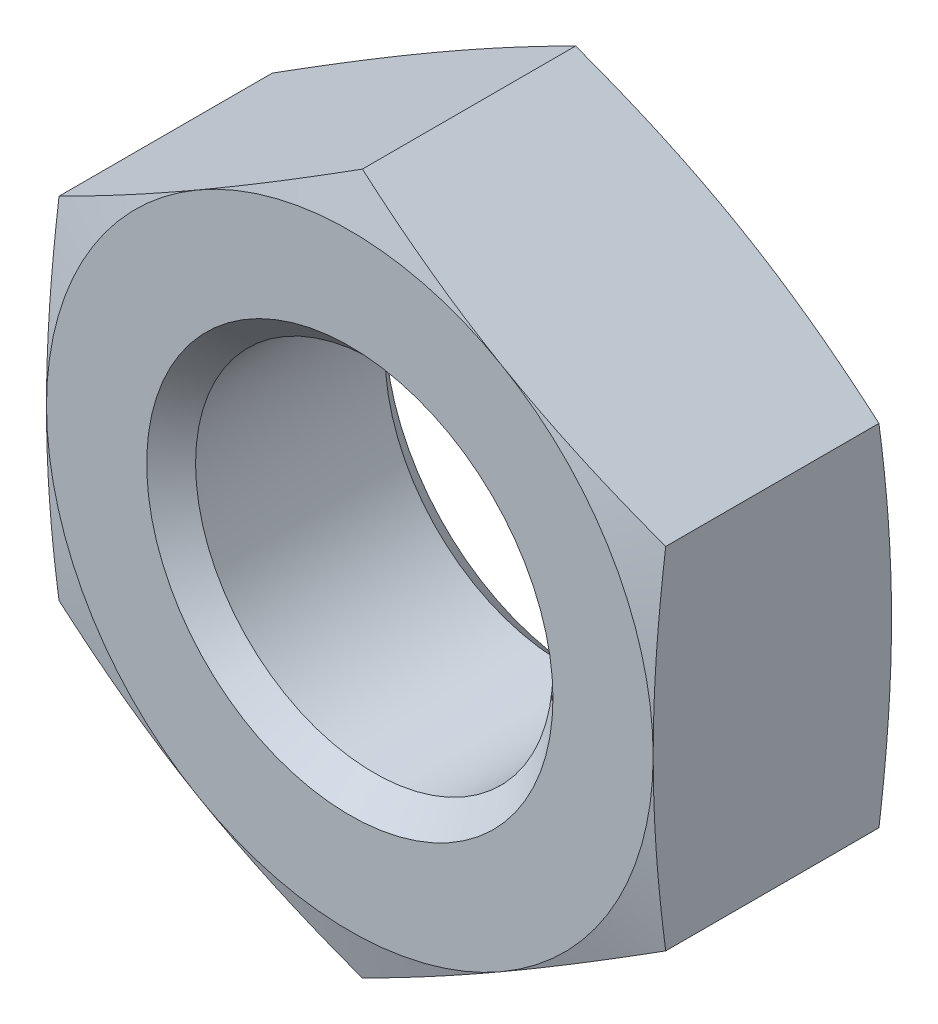
ISO-10303-21;
HEADER;
FILE_DESCRIPTION(('STEP AP214'),'2;1');
FILE_NAME('part.step','',(''),(''),'','','');
FILE_SCHEMA(('AUTOMOTIVE_DESIGN { 1 0 10303 214 1 1 1 1 }'));
ENDSEC;
DATA;
#1=APPLICATION_CONTEXT('core data for automotive mechanical design processes');
#2=APPLICATION_PROTOCOL_DEFINITION('international standard','automotive_design',2000,#1);
#3=PRODUCT_CONTEXT('',#1,'mechanical');
#4=PRODUCT('Part','Part','',(#3));
#5=PRODUCT_RELATED_PRODUCT_CATEGORY('part','',(#4));
#6=PRODUCT_DEFINITION_FORMATION('','',#4);
#7=PRODUCT_DEFINITION_CONTEXT('part definition',#1,'design');
#8=PRODUCT_DEFINITION('design','',#6,#7);
#9=PRODUCT_DEFINITION_SHAPE('','',#8);
#10=(LENGTH_UNIT() NAMED_UNIT(*) SI_UNIT(.MILLI.,.METRE.));
#11=(NAMED_UNIT(*) PLANE_ANGLE_UNIT() SI_UNIT($,.RADIAN.));
#12=(NAMED_UNIT(*) SI_UNIT($,.STERADIAN.) SOLID_ANGLE_UNIT());
#13=UNCERTAINTY_MEASURE_WITH_UNIT(LENGTH_MEASURE(1.E-05),#10,'distance_accuracy_value','');
#14=(GEOMETRIC_REPRESENTATION_CONTEXT(3) GLOBAL_UNCERTAINTY_ASSIGNED_CONTEXT((#13)) GLOBAL_UNIT_ASSIGNED_CONTEXT((#10,
#11,#12)) REPRESENTATION_CONTEXT('',''));
#15=CARTESIAN_POINT('',(0.,0.,0.));
#16=DIRECTION('',(0.,0.,1.));
#17=DIRECTION('',(1.,0.,0.));
#18=AXIS2_PLACEMENT_3D('',#15,#16,#17);
#19=CARTESIAN_POINT('',(0.,0.,0.));
#20=DIRECTION('',(0.,0.,-1.));
#21=DIRECTION('',(-1.,0.,0.));
#22=AXIS2_PLACEMENT_3D('',#19,#20,#21);
#23=PLANE('',#22);
#24=CARTESIAN_POINT('',(0.,0.,0.));
#25=DIRECTION('',(0.,0.,1.));
#26=DIRECTION('',(1.,0.,0.));
#27=AXIS2_PLACEMENT_3D('',#24,#25,#26);
#28=CIRCLE('',#27,7.112);
#29=CARTESIAN_POINT('',(7.112,0.,0.));
#30=VERTEX_POINT('',#29);
#31=CARTESIAN_POINT('',(3.55599999999998,6.15917267171491,0.));
#32=VERTEX_POINT('',#31);
#33=EDGE_CURVE('E11',#30,#32,#28,.T.);
#34=ORIENTED_EDGE('',*,*,#33,.T.);
#35=CARTESIAN_POINT('',(-3.55599999999998,6.15917267171491,0.));
#36=VERTEX_POINT('',#35);
#37=EDGE_CURVE('E43',#32,#36,#28,.T.);
#38=ORIENTED_EDGE('',*,*,#37,.T.);
#39=CARTESIAN_POINT('',(-7.112,0.,0.));
#40=VERTEX_POINT('',#39);
#41=EDGE_CURVE('E328',#36,#40,#28,.T.);
#42=ORIENTED_EDGE('',*,*,#41,.T.);
#43=CARTESIAN_POINT('',(-3.55599999999998,-6.15917267171491,0.));
#44=VERTEX_POINT('',#43);
#45=EDGE_CURVE('E321',#40,#44,#28,.T.);
#46=ORIENTED_EDGE('',*,*,#45,.T.);
#47=CARTESIAN_POINT('',(3.55599999999998,-6.15917267171491,0.));
#48=VERTEX_POINT('',#47);
#49=EDGE_CURVE('E324',#44,#48,#28,.T.);
#50=ORIENTED_EDGE('',*,*,#49,.T.);
#51=EDGE_CURVE('E44',#48,#30,#28,.T.);
#52=ORIENTED_EDGE('',*,*,#51,.T.);
#53=EDGE_LOOP('',(#34,#38,#42,#46,#50,#52));
#54=FACE_BOUND('',#53,.T.);
#55=CARTESIAN_POINT('',(0.,0.,0.));
#56=DIRECTION('',(0.,0.,1.));
#57=DIRECTION('',(1.,0.,0.));
#58=AXIS2_PLACEMENT_3D('',#55,#56,#57);
#59=CIRCLE('',#58,4.7625);
#60=CARTESIAN_POINT('',(4.7625,0.,0.));
#61=VERTEX_POINT('',#60);
#62=EDGE_CURVE('E185',#61,#61,#59,.T.);
#63=ORIENTED_EDGE('',*,*,#62,.F.);
#64=EDGE_LOOP('',(#63));
#65=FACE_BOUND('',#64,.T.);
#66=ADVANCED_FACE('F36',(#54,#65),#23,.F.);
#67=CARTESIAN_POINT('',(0.,7.112,-5.588));
#68=DIRECTION('',(0.,0.,1.));
#69=DIRECTION('',(1.,0.,0.));
#70=AXIS2_PLACEMENT_3D('',#67,#68,#69);
#71=PLANE('',#70);
#72=CARTESIAN_POINT('',(0.,0.,-5.588));
#73=DIRECTION('',(0.,0.,1.));
#74=DIRECTION('',(1.,0.,0.));
#75=AXIS2_PLACEMENT_3D('',#72,#73,#74);
#76=CIRCLE('',#75,7.112);
#77=CARTESIAN_POINT('',(7.112,0.,-5.588));
#78=VERTEX_POINT('',#77);
#79=CARTESIAN_POINT('',(3.55599999999998,6.15917267171491,-5.588));
#80=VERTEX_POINT('',#79);
#81=EDGE_CURVE('E359',#78,#80,#76,.T.);
#82=ORIENTED_EDGE('',*,*,#81,.F.);
#83=CARTESIAN_POINT('',(3.55599999999998,-6.15917267171491,-5.588));
#84=VERTEX_POINT('',#83);
#85=EDGE_CURVE('E362',#84,#78,#76,.T.);
#86=ORIENTED_EDGE('',*,*,#85,.F.);
#87=CARTESIAN_POINT('',(-3.55599999999997,-6.15917267171491,-5.588));
#88=VERTEX_POINT('',#87);
#89=EDGE_CURVE('E363',#88,#84,#76,.T.);
#90=ORIENTED_EDGE('',*,*,#89,.F.);
#91=CARTESIAN_POINT('',(-7.112,0.,-5.588));
#92=VERTEX_POINT('',#91);
#93=EDGE_CURVE('E143',#92,#88,#76,.T.);
#94=ORIENTED_EDGE('',*,*,#93,.F.);
#95=CARTESIAN_POINT('',(-3.55599999999998,6.15917267171491,-5.588));
#96=VERTEX_POINT('',#95);
#97=EDGE_CURVE('E360',#96,#92,#76,.T.);
#98=ORIENTED_EDGE('',*,*,#97,.F.);
#99=EDGE_CURVE('E356',#80,#96,#76,.T.);
#100=ORIENTED_EDGE('',*,*,#99,.F.);
#101=EDGE_LOOP('',(#82,#86,#90,#94,#98,#100));
#102=FACE_BOUND('',#101,.T.);
#103=CARTESIAN_POINT('',(0.,0.,-5.588));
#104=DIRECTION('',(0.,0.,1.));
#105=DIRECTION('',(1.,0.,0.));
#106=AXIS2_PLACEMENT_3D('',#103,#104,#105);
#107=CIRCLE('',#106,4.7625);
#108=CARTESIAN_POINT('',(4.7625,0.,-5.588));
#109=VERTEX_POINT('',#108);
#110=EDGE_CURVE('E205',#109,#109,#107,.T.);
#111=ORIENTED_EDGE('',*,*,#110,.T.);
#112=EDGE_LOOP('',(#111));
#113=FACE_BOUND('',#112,.T.);
#114=ADVANCED_FACE('F209',(#102,#113),#71,.F.);
#115=CARTESIAN_POINT('',(0.,0.,-0.38113093131403));
#116=DIRECTION('',(0.,0.,-1.));
#117=DIRECTION('',(-1.,0.,0.));
#118=AXIS2_PLACEMENT_3D('',#115,#116,#117);
#119=CONICAL_SURFACE('',#118,8.5344,1.30899693899575);
#120=CARTESIAN_POINT('',(-7.1122,4.10599964442276,-0.294836742096555));
#121=CARTESIAN_POINT('',(-6.81683993081672,4.27652585987359,-0.249125164728864));
#122=CARTESIAN_POINT('',(-6.52094434048185,4.44736125860545,-0.20762659679499));
#123=CARTESIAN_POINT('',(-5.92810818304476,4.7896353736871,-0.134717505456008));
#124=CARTESIAN_POINT('',(-5.63116724085637,4.96107430659299,-0.103311079605058));
#125=CARTESIAN_POINT('',(-5.03804073152478,5.30351605641908,-0.0524197564883193));
#126=CARTESIAN_POINT('',(-4.741859175091,5.47451655775512,-0.0328741692317776));
#127=CARTESIAN_POINT('',(-4.14911835631021,5.81673562903789,-0.00666553721840267));
#128=CARTESIAN_POINT('',(-3.85255917815511,5.9879541503764,0.));
#129=CARTESIAN_POINT('',(-3.25944082184489,6.3303911930534,0.));
#130=CARTESIAN_POINT('',(-2.96288164368979,6.50160971439191,-0.00666553721840112));
#131=CARTESIAN_POINT('',(-2.370140824909,6.84382878567467,-0.0328741692317746));
#132=CARTESIAN_POINT('',(-2.07395926847522,7.01482928701071,-0.0524197564883157));
#133=CARTESIAN_POINT('',(-1.48083275914363,7.35727103683681,-0.103311079605053));
#134=CARTESIAN_POINT('',(-1.18389181695524,7.5287099697427,-0.134717505456002));
#135=CARTESIAN_POINT('',(-0.591055659518146,7.87098408482435,-0.207626596794984));
#136=CARTESIAN_POINT('',(-0.295160069183277,8.04181948355621,-0.249125164728857));
#137=CARTESIAN_POINT('',(0.000199999999999879,8.21234569900704,-0.294836742096548));
#138=B_SPLINE_CURVE_WITH_KNOTS('',3,(#120,#121,#122,#123,#124,#125,#126,#127,#128,#129,#130,
#131,#132,#133,#134,#135,#136,#137),.UNSPECIFIED.,.F.,.F.,(4,2,2,2,2,2,2,2,4),(0.,
1.03236062173259,2.06513986860236,3.09258898445301,4.11983925526856,5.14708952608412,
6.17453864193476,7.20731788880454,8.23967851053712),.UNSPECIFIED.);
#139=CARTESIAN_POINT('',(-7.112,4.1061151144766,-0.294805801336327));
#140=VERTEX_POINT('',#139);
#141=EDGE_CURVE('E336',#140,#36,#138,.T.);
#142=ORIENTED_EDGE('',*,*,#141,.F.);
#143=CARTESIAN_POINT('',(-7.112,-10.8621903802248,-1.57322706787647));
#144=CARTESIAN_POINT('',(-7.112,-10.5395393800562,-1.50091696809899));
#145=CARTESIAN_POINT('',(-7.112,-10.2166865718283,-1.42949122415335));
#146=CARTESIAN_POINT('',(-7.112,-9.57047822851532,-1.28888580152898));
#147=CARTESIAN_POINT('',(-7.112,-9.24712267234835,-1.21970621985545));
#148=CARTESIAN_POINT('',(-7.112,-8.5995200627725,-1.08401027295991));
#149=CARTESIAN_POINT('',(-7.112,-8.27527244600282,-1.01749658678487));
#150=CARTESIAN_POINT('',(-7.112,-7.62610232214974,-0.887850374036113));
#151=CARTESIAN_POINT('',(-7.112,-7.30117982078632,-0.8247178189261));
#152=CARTESIAN_POINT('',(-7.112,-6.65313387237915,-0.703125566688923));
#153=CARTESIAN_POINT('',(-7.112,-6.33001668255371,-0.644632684578964));
#154=CARTESIAN_POINT('',(-7.112,-5.68290093786014,-0.532753637731037));
#155=CARTESIAN_POINT('',(-7.112,-5.35890240254682,-0.479367360625761));
#156=CARTESIAN_POINT('',(-7.112,-4.70996107077876,-0.378903566930172));
#157=CARTESIAN_POINT('',(-7.112,-4.38501839561018,-0.331825273692812));
#158=CARTESIAN_POINT('',(-7.112,-3.73409901356861,-0.245364767985313));
#159=CARTESIAN_POINT('',(-7.112,-3.40812230572716,-0.2059825627253));
#160=CARTESIAN_POINT('',(-7.112,-2.75145723580076,-0.136029395787059));
#161=CARTESIAN_POINT('',(-7.112,-2.42075747702392,-0.105563829583138));
#162=CARTESIAN_POINT('',(-7.112,-1.75852657520964,-0.0555456253999336));
#163=CARTESIAN_POINT('',(-7.112,-1.42699545141392,-0.0359927371490908));
#164=CARTESIAN_POINT('',(-7.112,-0.763582735895716,-0.00894029218373607));
#165=CARTESIAN_POINT('',(-7.112,-0.431701372123297,-0.00143525798414603));
#166=CARTESIAN_POINT('',(-7.112,0.232109083172494,0.00106005450740887));
#167=CARTESIAN_POINT('',(-7.112,0.564038174654477,-0.00394965641241315));
#168=CARTESIAN_POINT('',(-7.112,1.22868554534926,-0.0262021054193241));
#169=CARTESIAN_POINT('',(-7.112,1.56140230772255,-0.043489241985777));
#170=CARTESIAN_POINT('',(-7.112,2.22605336021326,-0.0893097661187412));
#171=CARTESIAN_POINT('',(-7.112,2.55798763284348,-0.117843402671249));
#172=CARTESIAN_POINT('',(-7.112,3.2210709139855,-0.184715603901281));
#173=CARTESIAN_POINT('',(-7.112,3.55221926714478,-0.223060567325219));
#174=CARTESIAN_POINT('',(-7.112,4.21345025232476,-0.307959864517774));
#175=CARTESIAN_POINT('',(-7.112,4.54353288099616,-0.354514224060884));
#176=CARTESIAN_POINT('',(-7.112,5.18084428686068,-0.451037958316589));
#177=CARTESIAN_POINT('',(-7.112,5.48813890421502,-0.500576999648263));
#178=CARTESIAN_POINT('',(-7.112,6.1019181959131,-0.604463692319849));
#179=CARTESIAN_POINT('',(-7.112,6.40840284792414,-0.658811474852727));
#180=CARTESIAN_POINT('',(-7.112,7.02067434834207,-0.77143588349716));
#181=CARTESIAN_POINT('',(-7.112,7.3264611316708,-0.829712861688587));
#182=CARTESIAN_POINT('',(-7.112,7.93740665686525,-0.949478379785007));
#183=CARTESIAN_POINT('',(-7.112,8.24256539054058,-1.01096696130012));
#184=CARTESIAN_POINT('',(-7.112,9.15736958006377,-1.19937760033226));
#185=CARTESIAN_POINT('',(-7.112,9.76620698844964,-1.33021895563952));
#186=CARTESIAN_POINT('',(-7.112,10.9822626667456,-1.59898474911041));
#187=CARTESIAN_POINT('',(-7.112,11.5894810291877,-1.73690877294287));
#188=CARTESIAN_POINT('',(-7.112,12.7967984662328,-2.01636676367255));
#189=CARTESIAN_POINT('',(-7.112,13.3969088656803,-2.15785193980808));
#190=CARTESIAN_POINT('',(-7.112,14.5962924563601,-2.44436443899914));
#191=CARTESIAN_POINT('',(-7.112,15.1955656321298,-2.58939182658433));
#192=CARTESIAN_POINT('',(-7.112,16.3927321601189,-2.88188317193209));
#193=CARTESIAN_POINT('',(-7.112,16.9906263024909,-3.02934390204586));
#194=CARTESIAN_POINT('',(-7.112,18.1858937839348,-3.32627890644586));
#195=CARTESIAN_POINT('',(-7.112,18.7832671395427,-3.47575311412247));
#196=CARTESIAN_POINT('',(-7.112,19.3804589835755,-3.62594037951843));
#197=B_SPLINE_CURVE_WITH_KNOTS('',3,(#143,#144,#145,#146,#147,#148,#149,#150,#151,#152,#153,
#154,#155,#156,#157,#158,#159,#160,#161,#162,#163,#164,#165,#166,#167,#168,#169,#170,#171,#172,
#173,#174,#175,#176,#177,#178,#179,#180,#181,#182,#183,#184,#185,#186,#187,#188,#189,#190,#191,
#192,#193,#194,#195,#196),.UNSPECIFIED.,.F.,.F.,(4,2,2,2,2,2,2,2,2,2,2,2,2,2,2,2,2,2,2,2,2,2,2,
2,2,2,4),(0.,0.991967628235665,1.98397803983594,2.97696156258089,3.96993670335537,
4.9550106822231,5.94006298023104,6.92499388567646,7.90992571385571,8.90606843566219,
9.90218831097408,10.8978551779253,11.893521186572,12.8928062468735,13.8921134315661,
14.8920740125303,15.8920377330598,16.825779045118,17.7595458395382,18.6933964166397,
19.6272590958812,21.495399659747,23.3634310629121,25.213106344653,27.0628153477217,
28.9102417570089,30.7576071993245),.UNSPECIFIED.);
#198=EDGE_CURVE('E154',#40,#140,#197,.T.);
#199=ORIENTED_EDGE('',*,*,#198,.F.);
#200=ORIENTED_EDGE('',*,*,#41,.F.);
#201=EDGE_LOOP('',(#142,#199,#200));
#202=FACE_BOUND('',#201,.T.);
#203=ADVANCED_FACE('F227',(#202),#119,.T.);
#204=CARTESIAN_POINT('',(0.,8.2122302289532,-0.29480580133632));
#205=VERTEX_POINT('',#204);
#206=EDGE_CURVE('E333',#36,#205,#138,.T.);
#207=ORIENTED_EDGE('',*,*,#206,.F.);
#208=ORIENTED_EDGE('',*,*,#37,.F.);
#209=CARTESIAN_POINT('',(-0.0002,8.21234569900704,-0.294836742096548));
#210=CARTESIAN_POINT('',(0.295160069183277,8.04181948355621,-0.249125164728857));
#211=CARTESIAN_POINT('',(0.591055659518147,7.87098408482435,-0.207626596794983));
#212=CARTESIAN_POINT('',(1.18389181695524,7.5287099697427,-0.134717505456002));
#213=CARTESIAN_POINT('',(1.48083275914363,7.35727103683681,-0.103311079605053));
#214=CARTESIAN_POINT('',(2.07395926847522,7.01482928701071,-0.0524197564883157));
#215=CARTESIAN_POINT('',(2.370140824909,6.84382878567467,-0.0328741692317747));
#216=CARTESIAN_POINT('',(2.96288164368979,6.50160971439191,-0.00666553721840107));
#217=CARTESIAN_POINT('',(3.2594408218449,6.3303911930534,0.));
#218=CARTESIAN_POINT('',(3.85255917815511,5.9879541503764,0.));
#219=CARTESIAN_POINT('',(4.14911835631021,5.81673562903789,-0.00666553721840278));
#220=CARTESIAN_POINT('',(4.74185917509101,5.47451655775512,-0.0328741692317779));
#221=CARTESIAN_POINT('',(5.03804073152478,5.30351605641908,-0.0524197564883196));
#222=CARTESIAN_POINT('',(5.63116724085637,4.96107430659298,-0.103311079605058));
#223=CARTESIAN_POINT('',(5.92810818304476,4.7896353736871,-0.134717505456008));
#224=CARTESIAN_POINT('',(6.52094434048186,4.44736125860545,-0.20762659679499));
#225=CARTESIAN_POINT('',(6.81683993081672,4.27652585987359,-0.249125164728864));
#226=CARTESIAN_POINT('',(7.1122,4.10599964442276,-0.294836742096555));
#227=B_SPLINE_CURVE_WITH_KNOTS('',3,(#209,#210,#211,#212,#213,#214,#215,#216,#217,#218,#219,
#220,#221,#222,#223,#224,#225,#226),.UNSPECIFIED.,.F.,.F.,(4,2,2,2,2,2,2,2,4),(0.,
1.03236062173259,2.06513986860236,3.09258898445301,4.11983925526856,5.14708952608412,
6.17453864193476,7.20731788880454,8.23967851053712),.UNSPECIFIED.);
#228=EDGE_CURVE('E266',#205,#32,#227,.T.);
#229=ORIENTED_EDGE('',*,*,#228,.F.);
#230=EDGE_LOOP('',(#207,#208,#229));
#231=FACE_BOUND('',#230,.T.);
#232=ADVANCED_FACE('F275',(#231),#119,.T.);
#233=CARTESIAN_POINT('',(7.112,4.1061151144766,-0.294805801336327));
#234=VERTEX_POINT('',#233);
#235=EDGE_CURVE('E261',#32,#234,#227,.T.);
#236=ORIENTED_EDGE('',*,*,#235,.F.);
#237=ORIENTED_EDGE('',*,*,#33,.F.);
#238=CARTESIAN_POINT('',(7.112,-10.8621903802248,-1.57322706787647));
#239=CARTESIAN_POINT('',(7.112,-10.5395393800562,-1.50091696809899));
#240=CARTESIAN_POINT('',(7.112,-10.2166865718283,-1.42949122415335));
#241=CARTESIAN_POINT('',(7.112,-9.57047822851532,-1.28888580152898));
#242=CARTESIAN_POINT('',(7.112,-9.24712267234835,-1.21970621985545));
#243=CARTESIAN_POINT('',(7.112,-8.5995200627725,-1.08401027295991));
#244=CARTESIAN_POINT('',(7.112,-8.27527244600282,-1.01749658678487));
#245=CARTESIAN_POINT('',(7.112,-7.62610232214974,-0.887850374036113));
#246=CARTESIAN_POINT('',(7.112,-7.30117982078632,-0.8247178189261));
#247=CARTESIAN_POINT('',(7.112,-6.65313387237915,-0.703125566688923));
#248=CARTESIAN_POINT('',(7.112,-6.33001668255371,-0.644632684578964));
#249=CARTESIAN_POINT('',(7.112,-5.68290093786014,-0.532753637731037));
#250=CARTESIAN_POINT('',(7.112,-5.35890240254682,-0.479367360625761));
#251=CARTESIAN_POINT('',(7.112,-4.70996107077876,-0.378903566930172));
#252=CARTESIAN_POINT('',(7.112,-4.38501839561018,-0.331825273692812));
#253=CARTESIAN_POINT('',(7.112,-3.73409901356861,-0.245364767985313));
#254=CARTESIAN_POINT('',(7.112,-3.40812230572716,-0.2059825627253));
#255=CARTESIAN_POINT('',(7.112,-2.75145723580076,-0.136029395787059));
#256=CARTESIAN_POINT('',(7.112,-2.42075747702392,-0.105563829583138));
#257=CARTESIAN_POINT('',(7.112,-1.75852657520964,-0.0555456253999336));
#258=CARTESIAN_POINT('',(7.112,-1.42699545141392,-0.0359927371490908));
#259=CARTESIAN_POINT('',(7.112,-0.763582735895716,-0.00894029218373607));
#260=CARTESIAN_POINT('',(7.112,-0.431701372123297,-0.00143525798414603));
#261=CARTESIAN_POINT('',(7.112,0.232109083172494,0.00106005450740887));
#262=CARTESIAN_POINT('',(7.112,0.564038174654477,-0.00394965641241315));
#263=CARTESIAN_POINT('',(7.112,1.22868554534926,-0.0262021054193241));
#264=CARTESIAN_POINT('',(7.112,1.56140230772255,-0.043489241985777));
#265=CARTESIAN_POINT('',(7.112,2.22605336021326,-0.0893097661187412));
#266=CARTESIAN_POINT('',(7.112,2.55798763284348,-0.117843402671249));
#267=CARTESIAN_POINT('',(7.112,3.2210709139855,-0.184715603901281));
#268=CARTESIAN_POINT('',(7.112,3.55221926714478,-0.223060567325219));
#269=CARTESIAN_POINT('',(7.112,4.21345025232476,-0.307959864517774));
#270=CARTESIAN_POINT('',(7.112,4.54353288099616,-0.354514224060884));
#271=CARTESIAN_POINT('',(7.112,5.18084428686068,-0.451037958316589));
#272=CARTESIAN_POINT('',(7.112,5.48813890421502,-0.500576999648263));
#273=CARTESIAN_POINT('',(7.112,6.1019181959131,-0.604463692319849));
#274=CARTESIAN_POINT('',(7.112,6.40840284792414,-0.658811474852727));
#275=CARTESIAN_POINT('',(7.112,7.02067434834207,-0.77143588349716));
#276=CARTESIAN_POINT('',(7.112,7.3264611316708,-0.829712861688587));
#277=CARTESIAN_POINT('',(7.112,7.93740665686525,-0.949478379785007));
#278=CARTESIAN_POINT('',(7.112,8.24256539054058,-1.01096696130012));
#279=CARTESIAN_POINT('',(7.112,9.15736958006377,-1.19937760033226));
#280=CARTESIAN_POINT('',(7.112,9.76620698844964,-1.33021895563952));
#281=CARTESIAN_POINT('',(7.112,10.9822626667456,-1.59898474911041));
#282=CARTESIAN_POINT('',(7.112,11.5894810291877,-1.73690877294287));
#283=CARTESIAN_POINT('',(7.112,12.7967984662328,-2.01636676367255));
#284=CARTESIAN_POINT('',(7.112,13.3969088656803,-2.15785193980808));
#285=CARTESIAN_POINT('',(7.112,14.5962924563601,-2.44436443899914));
#286=CARTESIAN_POINT('',(7.112,15.1955656321298,-2.58939182658433));
#287=CARTESIAN_POINT('',(7.112,16.3927321601189,-2.88188317193209));
#288=CARTESIAN_POINT('',(7.112,16.9906263024909,-3.02934390204586));
#289=CARTESIAN_POINT('',(7.112,18.1858937839348,-3.32627890644586));
#290=CARTESIAN_POINT('',(7.112,18.7832671395427,-3.47575311412247));
#291=CARTESIAN_POINT('',(7.112,19.3804589835755,-3.62594037951843));
#292=B_SPLINE_CURVE_WITH_KNOTS('',3,(#238,#239,#240,#241,#242,#243,#244,#245,#246,#247,#248,
#249,#250,#251,#252,#253,#254,#255,#256,#257,#258,#259,#260,#261,#262,#263,#264,#265,#266,#267,
#268,#269,#270,#271,#272,#273,#274,#275,#276,#277,#278,#279,#280,#281,#282,#283,#284,#285,#286,
#287,#288,#289,#290,#291),.UNSPECIFIED.,.F.,.F.,(4,2,2,2,2,2,2,2,2,2,2,2,2,2,2,2,2,2,2,2,2,2,2,
2,2,2,4),(0.,0.991967628235665,1.98397803983594,2.97696156258089,3.96993670335537,
4.9550106822231,5.94006298023104,6.92499388567646,7.90992571385571,8.90606843566219,
9.90218831097408,10.8978551779253,11.893521186572,12.8928062468735,13.8921134315661,
14.8920740125303,15.8920377330598,16.825779045118,17.7595458395382,18.6933964166397,
19.6272590958812,21.495399659747,23.3634310629121,25.213106344653,27.0628153477217,
28.9102417570089,30.7576071993245),.UNSPECIFIED.);
#293=EDGE_CURVE('E293',#234,#30,#292,.F.);
#294=ORIENTED_EDGE('',*,*,#293,.F.);
#295=EDGE_LOOP('',(#236,#237,#294));
#296=FACE_BOUND('',#295,.T.);
#297=ADVANCED_FACE('F347',(#296),#119,.T.);
#298=CARTESIAN_POINT('',(7.112,-4.1061151144766,-0.294805801336327));
#299=VERTEX_POINT('',#298);
#300=EDGE_CURVE('E289',#30,#299,#292,.F.);
#301=ORIENTED_EDGE('',*,*,#300,.F.);
#302=ORIENTED_EDGE('',*,*,#51,.F.);
#303=CARTESIAN_POINT('',(7.1122,-4.10599964442276,-0.294836742096555));
#304=CARTESIAN_POINT('',(6.81683993081672,-4.27652585987359,-0.249125164728864));
#305=CARTESIAN_POINT('',(6.52094434048185,-4.44736125860545,-0.20762659679499));
#306=CARTESIAN_POINT('',(5.92810818304476,-4.7896353736871,-0.134717505456008));
#307=CARTESIAN_POINT('',(5.63116724085637,-4.96107430659299,-0.103311079605058));
#308=CARTESIAN_POINT('',(5.03804073152478,-5.30351605641908,-0.0524197564883193));
#309=CARTESIAN_POINT('',(4.741859175091,-5.47451655775512,-0.0328741692317776));
#310=CARTESIAN_POINT('',(4.14911835631021,-5.81673562903789,-0.00666553721840267));
#311=CARTESIAN_POINT('',(3.85255917815511,-5.9879541503764,0.));
#312=CARTESIAN_POINT('',(3.25944082184489,-6.3303911930534,0.));
#313=CARTESIAN_POINT('',(2.96288164368979,-6.50160971439191,-0.00666553721840112));
#314=CARTESIAN_POINT('',(2.370140824909,-6.84382878567467,-0.0328741692317746));
#315=CARTESIAN_POINT('',(2.07395926847522,-7.01482928701071,-0.0524197564883157));
#316=CARTESIAN_POINT('',(1.48083275914363,-7.35727103683681,-0.103311079605053));
#317=CARTESIAN_POINT('',(1.18389181695524,-7.5287099697427,-0.134717505456002));
#318=CARTESIAN_POINT('',(0.591055659518146,-7.87098408482435,-0.207626596794984));
#319=CARTESIAN_POINT('',(0.295160069183277,-8.04181948355621,-0.249125164728857));
#320=CARTESIAN_POINT('',(-0.000199999999999879,-8.21234569900704,-0.294836742096548));
#321=B_SPLINE_CURVE_WITH_KNOTS('',3,(#303,#304,#305,#306,#307,#308,#309,#310,#311,#312,#313,
#314,#315,#316,#317,#318,#319,#320),.UNSPECIFIED.,.F.,.F.,(4,2,2,2,2,2,2,2,4),(0.,
1.03236062173259,2.06513986860236,3.09258898445301,4.11983925526856,5.14708952608412,
6.17453864193476,7.20731788880454,8.23967851053712),.UNSPECIFIED.);
#322=EDGE_CURVE('E299',#299,#48,#321,.T.);
#323=ORIENTED_EDGE('',*,*,#322,.F.);
#324=EDGE_LOOP('',(#301,#302,#323));
#325=FACE_BOUND('',#324,.T.);
#326=ADVANCED_FACE('F387',(#325),#119,.T.);
#327=CARTESIAN_POINT('',(0.,-8.2122302289532,-0.29480580133632));
#328=VERTEX_POINT('',#327);
#329=EDGE_CURVE('E284',#48,#328,#321,.T.);
#330=ORIENTED_EDGE('',*,*,#329,.F.);
#331=ORIENTED_EDGE('',*,*,#49,.F.);
#332=CARTESIAN_POINT('',(0.0002,-8.21234569900704,-0.294836742096548));
#333=CARTESIAN_POINT('',(-0.295160069183277,-8.04181948355621,-0.249125164728857));
#334=CARTESIAN_POINT('',(-0.591055659518147,-7.87098408482435,-0.207626596794983));
#335=CARTESIAN_POINT('',(-1.18389181695524,-7.5287099697427,-0.134717505456002));
#336=CARTESIAN_POINT('',(-1.48083275914363,-7.35727103683681,-0.103311079605053));
#337=CARTESIAN_POINT('',(-2.07395926847522,-7.01482928701071,-0.0524197564883157));
#338=CARTESIAN_POINT('',(-2.370140824909,-6.84382878567467,-0.0328741692317747));
#339=CARTESIAN_POINT('',(-2.96288164368979,-6.50160971439191,-0.00666553721840107));
#340=CARTESIAN_POINT('',(-3.2594408218449,-6.3303911930534,0.));
#341=CARTESIAN_POINT('',(-3.85255917815511,-5.9879541503764,0.));
#342=CARTESIAN_POINT('',(-4.14911835631021,-5.81673562903789,-0.00666553721840278));
#343=CARTESIAN_POINT('',(-4.74185917509101,-5.47451655775512,-0.0328741692317779));
#344=CARTESIAN_POINT('',(-5.03804073152478,-5.30351605641908,-0.0524197564883196));
#345=CARTESIAN_POINT('',(-5.63116724085637,-4.96107430659298,-0.103311079605058));
#346=CARTESIAN_POINT('',(-5.92810818304476,-4.7896353736871,-0.134717505456008));
#347=CARTESIAN_POINT('',(-6.52094434048186,-4.44736125860545,-0.20762659679499));
#348=CARTESIAN_POINT('',(-6.81683993081672,-4.27652585987359,-0.249125164728864));
#349=CARTESIAN_POINT('',(-7.1122,-4.10599964442276,-0.294836742096555));
#350=B_SPLINE_CURVE_WITH_KNOTS('',3,(#332,#333,#334,#335,#336,#337,#338,#339,#340,#341,#342,
#343,#344,#345,#346,#347,#348,#349),.UNSPECIFIED.,.F.,.F.,(4,2,2,2,2,2,2,2,4),(0.,
1.03236062173259,2.06513986860236,3.09258898445301,4.11983925526856,5.14708952608412,
6.17453864193476,7.20731788880454,8.23967851053712),.UNSPECIFIED.);
#351=EDGE_CURVE('E146',#328,#44,#350,.T.);
#352=ORIENTED_EDGE('',*,*,#351,.F.);
#353=EDGE_LOOP('',(#330,#331,#352));
#354=FACE_BOUND('',#353,.T.);
#355=ADVANCED_FACE('F325',(#354),#119,.T.);
#356=CARTESIAN_POINT('',(-7.112,-4.1061151144766,-0.294805801336327));
#357=VERTEX_POINT('',#356);
#358=EDGE_CURVE('E138',#44,#357,#350,.T.);
#359=ORIENTED_EDGE('',*,*,#358,.F.);
#360=ORIENTED_EDGE('',*,*,#45,.F.);
#361=EDGE_CURVE('E51',#357,#40,#197,.T.);
#362=ORIENTED_EDGE('',*,*,#361,.F.);
#363=EDGE_LOOP('',(#359,#360,#362));
#364=FACE_BOUND('',#363,.T.);
#365=ADVANCED_FACE('F277',(#364),#119,.T.);
#366=CARTESIAN_POINT('',(0.,8.2122302289532,-5.588));
#367=DIRECTION('',(-0.499999999999998,0.86602540378444,0.));
#368=DIRECTION('',(-0.86602540378444,-0.499999999999998,0.));
#369=AXIS2_PLACEMENT_3D('',#366,#367,#368);
#370=PLANE('',#369);
#371=ORIENTED_EDGE('',*,*,#141,.T.);
#372=ORIENTED_EDGE('',*,*,#206,.T.);
#373=DIRECTION('',(0.,0.,1.));
#374=VECTOR('',#373,1.);
#375=CARTESIAN_POINT('',(0.,8.2122302289532,-5.588));
#376=LINE('',#375,#374);
#377=CARTESIAN_POINT('',(0.,8.2122302289532,-5.2931941986637));
#378=VERTEX_POINT('',#377);
#379=EDGE_CURVE('E131',#378,#205,#376,.T.);
#380=ORIENTED_EDGE('',*,*,#379,.F.);
#381=CARTESIAN_POINT('',(0.000200000000000083,8.21234569900704,-5.29316325790348));
#382=CARTESIAN_POINT('',(-0.295160069183278,8.04181948355621,-5.33887483527116));
#383=CARTESIAN_POINT('',(-0.591055659518146,7.87098408482435,-5.38037340320503));
#384=CARTESIAN_POINT('',(-1.18389181695524,7.5287099697427,-5.45328249454401));
#385=CARTESIAN_POINT('',(-1.48083275914363,7.35727103683681,-5.48468892039496));
#386=CARTESIAN_POINT('',(-2.07395926847522,7.01482928701071,-5.53558024351169));
#387=CARTESIAN_POINT('',(-2.370140824909,6.84382878567467,-5.55512583076823));
#388=CARTESIAN_POINT('',(-2.96288164368979,6.50160971439191,-5.5813344627816));
#389=CARTESIAN_POINT('',(-3.25944082184489,6.3303911930534,-5.58800000000001));
#390=CARTESIAN_POINT('',(-3.85255917815511,5.9879541503764,-5.58800000000001));
#391=CARTESIAN_POINT('',(-4.14911835631021,5.81673562903789,-5.5813344627816));
#392=CARTESIAN_POINT('',(-4.741859175091,5.47451655775512,-5.55512583076823));
#393=CARTESIAN_POINT('',(-5.03804073152478,5.30351605641908,-5.53558024351168));
#394=CARTESIAN_POINT('',(-5.63116724085637,4.96107430659299,-5.48468892039495));
#395=CARTESIAN_POINT('',(-5.92810818304476,4.7896353736871,-5.453282494544));
#396=CARTESIAN_POINT('',(-6.52094434048185,4.44736125860545,-5.38037340320503));
#397=CARTESIAN_POINT('',(-6.81683993081672,4.27652585987359,-5.33887483527116));
#398=CARTESIAN_POINT('',(-7.1122,4.10599964442276,-5.29316325790347));
#399=B_SPLINE_CURVE_WITH_KNOTS('',3,(#381,#382,#383,#384,#385,#386,#387,#388,#389,#390,#391,
#392,#393,#394,#395,#396,#397,#398),.UNSPECIFIED.,.F.,.F.,(4,2,2,2,2,2,2,2,4),(0.,
1.03236062173258,2.06513986860236,3.092588984453,4.11983925526856,5.14708952608411,
6.17453864193476,7.20731788880453,8.23967851053712),.UNSPECIFIED.);
#400=EDGE_CURVE('E337',#378,#96,#399,.T.);
#401=ORIENTED_EDGE('',*,*,#400,.T.);
#402=CARTESIAN_POINT('',(-7.112,4.1061151144766,-5.2931941986637));
#403=VERTEX_POINT('',#402);
#404=EDGE_CURVE('E268',#96,#403,#399,.T.);
#405=ORIENTED_EDGE('',*,*,#404,.T.);
#406=DIRECTION('',(0.,0.,1.));
#407=VECTOR('',#406,1.);
#408=CARTESIAN_POINT('',(-7.112,4.1061151144766,-5.588));
#409=LINE('',#408,#407);
#410=EDGE_CURVE('E140',#403,#140,#409,.T.);
#411=ORIENTED_EDGE('',*,*,#410,.T.);
#412=EDGE_LOOP('',(#371,#372,#380,#401,#405,#411));
#413=FACE_BOUND('',#412,.T.);
#414=ADVANCED_FACE('F177',(#413),#370,.T.);
#415=CARTESIAN_POINT('',(7.112,4.1061151144766,-5.588));
#416=DIRECTION('',(0.499999999999998,0.86602540378444,0.));
#417=DIRECTION('',(-0.86602540378444,0.499999999999998,0.));
#418=AXIS2_PLACEMENT_3D('',#415,#416,#417);
#419=PLANE('',#418);
#420=ORIENTED_EDGE('',*,*,#228,.T.);
#421=ORIENTED_EDGE('',*,*,#235,.T.);
#422=DIRECTION('',(0.,0.,1.));
#423=VECTOR('',#422,1.);
#424=CARTESIAN_POINT('',(7.112,4.1061151144766,-5.588));
#425=LINE('',#424,#423);
#426=CARTESIAN_POINT('',(7.112,4.1061151144766,-5.2931941986637));
#427=VERTEX_POINT('',#426);
#428=EDGE_CURVE('E192',#427,#234,#425,.T.);
#429=ORIENTED_EDGE('',*,*,#428,.F.);
#430=CARTESIAN_POINT('',(7.1122,4.10599964442276,-5.29316325790347));
#431=CARTESIAN_POINT('',(6.81683993081672,4.27652585987359,-5.33887483527116));
#432=CARTESIAN_POINT('',(6.52094434048185,4.44736125860545,-5.38037340320503));
#433=CARTESIAN_POINT('',(5.92810818304476,4.7896353736871,-5.453282494544));
#434=CARTESIAN_POINT('',(5.63116724085637,4.96107430659299,-5.48468892039495));
#435=CARTESIAN_POINT('',(5.03804073152478,5.30351605641908,-5.53558024351168));
#436=CARTESIAN_POINT('',(4.741859175091,5.47451655775512,-5.55512583076823));
#437=CARTESIAN_POINT('',(4.14911835631021,5.81673562903789,-5.5813344627816));
#438=CARTESIAN_POINT('',(3.85255917815511,5.9879541503764,-5.58800000000001));
#439=CARTESIAN_POINT('',(3.25944082184489,6.3303911930534,-5.58800000000001));
#440=CARTESIAN_POINT('',(2.96288164368979,6.50160971439191,-5.5813344627816));
#441=CARTESIAN_POINT('',(2.370140824909,6.84382878567467,-5.55512583076823));
#442=CARTESIAN_POINT('',(2.07395926847522,7.01482928701072,-5.53558024351169));
#443=CARTESIAN_POINT('',(1.48083275914363,7.35727103683681,-5.48468892039496));
#444=CARTESIAN_POINT('',(1.18389181695524,7.5287099697427,-5.45328249454401));
#445=CARTESIAN_POINT('',(0.591055659518146,7.87098408482435,-5.38037340320503));
#446=CARTESIAN_POINT('',(0.295160069183276,8.04181948355621,-5.33887483527116));
#447=CARTESIAN_POINT('',(-0.00020000000000068,8.21234569900704,-5.29316325790348));
#448=B_SPLINE_CURVE_WITH_KNOTS('',3,(#430,#431,#432,#433,#434,#435,#436,#437,#438,#439,#440,
#441,#442,#443,#444,#445,#446,#447),.UNSPECIFIED.,.F.,.F.,(4,2,2,2,2,2,2,2,4),(0.,
1.03236062173259,2.06513986860236,3.09258898445301,4.11983925526856,5.14708952608412,
6.17453864193476,7.20731788880453,8.23967851053712),.UNSPECIFIED.);
#449=EDGE_CURVE('E267',#427,#80,#448,.T.);
#450=ORIENTED_EDGE('',*,*,#449,.T.);
#451=EDGE_CURVE('E255',#80,#378,#448,.T.);
#452=ORIENTED_EDGE('',*,*,#451,.T.);
#453=ORIENTED_EDGE('',*,*,#379,.T.);
#454=EDGE_LOOP('',(#420,#421,#429,#450,#452,#453));
#455=FACE_BOUND('',#454,.T.);
#456=ADVANCED_FACE('F247',(#455),#419,.T.);
#457=CARTESIAN_POINT('',(7.112,-4.1061151144766,-5.588));
#458=DIRECTION('',(1.,0.,0.));
#459=DIRECTION('',(0.,0.,-1.));
#460=AXIS2_PLACEMENT_3D('',#457,#458,#459);
#461=PLANE('',#460);
#462=ORIENTED_EDGE('',*,*,#293,.T.);
#463=ORIENTED_EDGE('',*,*,#300,.T.);
#464=DIRECTION('',(0.,0.,1.));
#465=VECTOR('',#464,1.);
#466=CARTESIAN_POINT('',(7.112,-4.1061151144766,-5.588));
#467=LINE('',#466,#465);
#468=CARTESIAN_POINT('',(7.112,-4.1061151144766,-5.2931941986637));
#469=VERTEX_POINT('',#468);
#470=EDGE_CURVE('E189',#469,#299,#467,.T.);
#471=ORIENTED_EDGE('',*,*,#470,.F.);
#472=CARTESIAN_POINT('',(7.112,-10.8621903802248,-4.01477293212366));
#473=CARTESIAN_POINT('',(7.112,-10.5395393800562,-4.08708303190113));
#474=CARTESIAN_POINT('',(7.112,-10.2166865718283,-4.15850877584677));
#475=CARTESIAN_POINT('',(7.112,-9.57047822851531,-4.29911419847113));
#476=CARTESIAN_POINT('',(7.112,-9.24712267234835,-4.36829378014464));
#477=CARTESIAN_POINT('',(7.112,-8.59952006277249,-4.50398972704018));
#478=CARTESIAN_POINT('',(7.112,-8.27527244600281,-4.57050341321521));
#479=CARTESIAN_POINT('',(7.112,-7.62610232214973,-4.70014962596396));
#480=CARTESIAN_POINT('',(7.112,-7.30117982078632,-4.76328218107397));
#481=CARTESIAN_POINT('',(7.112,-6.65313387237914,-4.88487443331113));
#482=CARTESIAN_POINT('',(7.112,-6.33001668255371,-4.94336731542109));
#483=CARTESIAN_POINT('',(7.112,-5.68290093786014,-5.05524636226901));
#484=CARTESIAN_POINT('',(7.112,-5.35890240254682,-5.10863263937428));
#485=CARTESIAN_POINT('',(7.112,-4.70996107077875,-5.20909643306986));
#486=CARTESIAN_POINT('',(7.112,-4.38501839561018,-5.25617472630722));
#487=CARTESIAN_POINT('',(7.112,-3.73409901356861,-5.34263523201471));
#488=CARTESIAN_POINT('',(7.112,-3.40812230572716,-5.38201743727472));
#489=CARTESIAN_POINT('',(7.112,-2.75145723580077,-5.45197060421295));
#490=CARTESIAN_POINT('',(7.112,-2.42075747702392,-5.48243617041687));
#491=CARTESIAN_POINT('',(7.112,-1.75852657520965,-5.53245437460007));
#492=CARTESIAN_POINT('',(7.112,-1.42699545141393,-5.55200726285091));
#493=CARTESIAN_POINT('',(7.112,-0.763582735895725,-5.57905970781627));
#494=CARTESIAN_POINT('',(7.112,-0.431701372123308,-5.58656474201585));
#495=CARTESIAN_POINT('',(7.112,0.232109083172481,-5.58906005450741));
#496=CARTESIAN_POINT('',(7.112,0.564038174654462,-5.58405034358759));
#497=CARTESIAN_POINT('',(7.112,1.22868554534924,-5.56179789458068));
#498=CARTESIAN_POINT('',(7.112,1.56140230772253,-5.54451075801423));
#499=CARTESIAN_POINT('',(7.112,2.22605336021324,-5.49869023388127));
#500=CARTESIAN_POINT('',(7.112,2.55798763284345,-5.47015659732876));
#501=CARTESIAN_POINT('',(7.112,3.22107091398548,-5.40328439609874));
#502=CARTESIAN_POINT('',(7.112,3.55221926714476,-5.3649394326748));
#503=CARTESIAN_POINT('',(7.112,4.21345025232473,-5.28004013548225));
#504=CARTESIAN_POINT('',(7.112,4.54353288099613,-5.23348577593915));
#505=CARTESIAN_POINT('',(7.112,5.18084428686065,-5.13696204168345));
#506=CARTESIAN_POINT('',(7.112,5.48813890421499,-5.08742300035178));
#507=CARTESIAN_POINT('',(7.112,6.10191819591307,-4.9835363076802));
#508=CARTESIAN_POINT('',(7.112,6.40840284792411,-4.92918852514733));
#509=CARTESIAN_POINT('',(7.112,7.02067434834205,-4.81656411650291));
#510=CARTESIAN_POINT('',(7.112,7.32646113167077,-4.75828713831148));
#511=CARTESIAN_POINT('',(7.112,7.93740665686522,-4.63852162021507));
#512=CARTESIAN_POINT('',(7.112,8.24256539054055,-4.57703303869997));
#513=CARTESIAN_POINT('',(7.112,9.15736958006375,-4.38862239966784));
#514=CARTESIAN_POINT('',(7.112,9.76620698844961,-4.25778104436059));
#515=CARTESIAN_POINT('',(7.112,10.9822626667456,-3.98901525088972));
#516=CARTESIAN_POINT('',(7.112,11.5894810291877,-3.85109122705727));
#517=CARTESIAN_POINT('',(7.112,12.7967984662327,-3.57163323632761));
#518=CARTESIAN_POINT('',(7.112,13.3969088656803,-3.43014806019209));
#519=CARTESIAN_POINT('',(7.112,14.5962924563601,-3.14363556100105));
#520=CARTESIAN_POINT('',(7.112,15.1955656321298,-2.99860817341588));
#521=CARTESIAN_POINT('',(7.112,16.3927321601189,-2.70611682806814));
#522=CARTESIAN_POINT('',(7.112,16.9906263024909,-2.55865609795438));
#523=CARTESIAN_POINT('',(7.112,18.1858937839348,-2.2617210935544));
#524=CARTESIAN_POINT('',(7.112,18.7832671395427,-2.1122468858778));
#525=CARTESIAN_POINT('',(7.112,19.3804589835756,-1.96205962048185));
#526=B_SPLINE_CURVE_WITH_KNOTS('',3,(#472,#473,#474,#475,#476,#477,#478,#479,#480,#481,#482,
#483,#484,#485,#486,#487,#488,#489,#490,#491,#492,#493,#494,#495,#496,#497,#498,#499,#500,#501,
#502,#503,#504,#505,#506,#507,#508,#509,#510,#511,#512,#513,#514,#515,#516,#517,#518,#519,#520,
#521,#522,#523,#524,#525),.UNSPECIFIED.,.F.,.F.,(4,2,2,2,2,2,2,2,2,2,2,2,2,2,2,2,2,2,2,2,2,2,2,
2,2,2,4),(0.,0.991967628235663,1.98397803983593,2.97696156258088,3.96993670335535,
4.95501068222308,5.94006298023102,6.92499388567644,7.90992571385569,8.90606843566216,
9.90218831097405,10.8978551779253,11.8935211865719,12.8928062468735,13.8921134315661,
14.8920740125303,15.8920377330598,16.825779045118,17.7595458395382,18.6933964166396,
19.6272590958812,21.4953996597469,23.3634310629121,25.2131063446529,27.0628153477216,
28.9102417570088,30.7576071993244),.UNSPECIFIED.);
#527=EDGE_CURVE('E294',#469,#78,#526,.T.);
#528=ORIENTED_EDGE('',*,*,#527,.T.);
#529=EDGE_CURVE('E295',#78,#427,#526,.T.);
#530=ORIENTED_EDGE('',*,*,#529,.T.);
#531=ORIENTED_EDGE('',*,*,#428,.T.);
#532=EDGE_LOOP('',(#462,#463,#471,#528,#530,#531));
#533=FACE_BOUND('',#532,.T.);
#534=ADVANCED_FACE('F250',(#533),#461,.T.);
#535=CARTESIAN_POINT('',(0.,-8.2122302289532,-5.588));
#536=DIRECTION('',(0.499999999999998,-0.86602540378444,0.));
#537=DIRECTION('',(0.86602540378444,0.499999999999998,0.));
#538=AXIS2_PLACEMENT_3D('',#535,#536,#537);
#539=PLANE('',#538);
#540=ORIENTED_EDGE('',*,*,#322,.T.);
#541=ORIENTED_EDGE('',*,*,#329,.T.);
#542=DIRECTION('',(0.,0.,1.));
#543=VECTOR('',#542,1.);
#544=CARTESIAN_POINT('',(0.,-8.2122302289532,-5.588));
#545=LINE('',#544,#543);
#546=CARTESIAN_POINT('',(0.,-8.2122302289532,-5.2931941986637));
#547=VERTEX_POINT('',#546);
#548=EDGE_CURVE('E139',#547,#328,#545,.T.);
#549=ORIENTED_EDGE('',*,*,#548,.F.);
#550=CARTESIAN_POINT('',(-0.000200000000000083,-8.21234569900704,-5.29316325790348));
#551=CARTESIAN_POINT('',(0.295160069183278,-8.04181948355621,-5.33887483527116));
#552=CARTESIAN_POINT('',(0.591055659518146,-7.87098408482435,-5.38037340320503));
#553=CARTESIAN_POINT('',(1.18389181695524,-7.5287099697427,-5.45328249454401));
#554=CARTESIAN_POINT('',(1.48083275914363,-7.35727103683681,-5.48468892039496));
#555=CARTESIAN_POINT('',(2.07395926847522,-7.01482928701071,-5.53558024351169));
#556=CARTESIAN_POINT('',(2.370140824909,-6.84382878567467,-5.55512583076823));
#557=CARTESIAN_POINT('',(2.96288164368979,-6.50160971439191,-5.5813344627816));
#558=CARTESIAN_POINT('',(3.25944082184489,-6.3303911930534,-5.58800000000001));
#559=CARTESIAN_POINT('',(3.85255917815511,-5.9879541503764,-5.58800000000001));
#560=CARTESIAN_POINT('',(4.14911835631021,-5.81673562903789,-5.5813344627816));
#561=CARTESIAN_POINT('',(4.741859175091,-5.47451655775512,-5.55512583076823));
#562=CARTESIAN_POINT('',(5.03804073152478,-5.30351605641908,-5.53558024351168));
#563=CARTESIAN_POINT('',(5.63116724085637,-4.96107430659299,-5.48468892039495));
#564=CARTESIAN_POINT('',(5.92810818304476,-4.7896353736871,-5.453282494544));
#565=CARTESIAN_POINT('',(6.52094434048185,-4.44736125860545,-5.38037340320503));
#566=CARTESIAN_POINT('',(6.81683993081672,-4.27652585987359,-5.33887483527116));
#567=CARTESIAN_POINT('',(7.1122,-4.10599964442276,-5.29316325790347));
#568=B_SPLINE_CURVE_WITH_KNOTS('',3,(#550,#551,#552,#553,#554,#555,#556,#557,#558,#559,#560,
#561,#562,#563,#564,#565,#566,#567),.UNSPECIFIED.,.F.,.F.,(4,2,2,2,2,2,2,2,4),(0.,
1.03236062173258,2.06513986860236,3.092588984453,4.11983925526856,5.14708952608411,
6.17453864193476,7.20731788880453,8.23967851053712),.UNSPECIFIED.);
#569=EDGE_CURVE('E306',#547,#84,#568,.T.);
#570=ORIENTED_EDGE('',*,*,#569,.T.);
#571=EDGE_CURVE('E308',#84,#469,#568,.T.);
#572=ORIENTED_EDGE('',*,*,#571,.T.);
#573=ORIENTED_EDGE('',*,*,#470,.T.);
#574=EDGE_LOOP('',(#540,#541,#549,#570,#572,#573));
#575=FACE_BOUND('',#574,.T.);
#576=ADVANCED_FACE('F169',(#575),#539,.T.);
#577=CARTESIAN_POINT('',(-7.112,-4.1061151144766,-5.588));
#578=DIRECTION('',(-0.499999999999998,-0.86602540378444,0.));
#579=DIRECTION('',(0.86602540378444,-0.499999999999998,0.));
#580=AXIS2_PLACEMENT_3D('',#577,#578,#579);
#581=PLANE('',#580);
#582=ORIENTED_EDGE('',*,*,#351,.T.);
#583=ORIENTED_EDGE('',*,*,#358,.T.);
#584=DIRECTION('',(0.,0.,1.));
#585=VECTOR('',#584,1.);
#586=CARTESIAN_POINT('',(-7.112,-4.1061151144766,-5.588));
#587=LINE('',#586,#585);
#588=CARTESIAN_POINT('',(-7.112,-4.1061151144766,-5.2931941986637));
#589=VERTEX_POINT('',#588);
#590=EDGE_CURVE('E126',#589,#357,#587,.T.);
#591=ORIENTED_EDGE('',*,*,#590,.F.);
#592=CARTESIAN_POINT('',(-7.1122,-4.10599964442276,-5.29316325790347));
#593=CARTESIAN_POINT('',(-6.81683993081672,-4.27652585987359,-5.33887483527116));
#594=CARTESIAN_POINT('',(-6.52094434048185,-4.44736125860545,-5.38037340320503));
#595=CARTESIAN_POINT('',(-5.92810818304476,-4.7896353736871,-5.453282494544));
#596=CARTESIAN_POINT('',(-5.63116724085637,-4.96107430659299,-5.48468892039495));
#597=CARTESIAN_POINT('',(-5.03804073152478,-5.30351605641908,-5.53558024351168));
#598=CARTESIAN_POINT('',(-4.741859175091,-5.47451655775512,-5.55512583076823));
#599=CARTESIAN_POINT('',(-4.14911835631021,-5.81673562903789,-5.5813344627816));
#600=CARTESIAN_POINT('',(-3.85255917815511,-5.9879541503764,-5.58800000000001));
#601=CARTESIAN_POINT('',(-3.25944082184489,-6.3303911930534,-5.58800000000001));
#602=CARTESIAN_POINT('',(-2.96288164368979,-6.50160971439191,-5.5813344627816));
#603=CARTESIAN_POINT('',(-2.370140824909,-6.84382878567467,-5.55512583076823));
#604=CARTESIAN_POINT('',(-2.07395926847522,-7.01482928701072,-5.53558024351169));
#605=CARTESIAN_POINT('',(-1.48083275914363,-7.35727103683681,-5.48468892039496));
#606=CARTESIAN_POINT('',(-1.18389181695524,-7.5287099697427,-5.45328249454401));
#607=CARTESIAN_POINT('',(-0.591055659518146,-7.87098408482435,-5.38037340320503));
#608=CARTESIAN_POINT('',(-0.295160069183276,-8.04181948355621,-5.33887483527116));
#609=CARTESIAN_POINT('',(0.00020000000000068,-8.21234569900704,-5.29316325790348));
#610=B_SPLINE_CURVE_WITH_KNOTS('',3,(#592,#593,#594,#595,#596,#597,#598,#599,#600,#601,#602,
#603,#604,#605,#606,#607,#608,#609),.UNSPECIFIED.,.F.,.F.,(4,2,2,2,2,2,2,2,4),(0.,
1.03236062173259,2.06513986860236,3.09258898445301,4.11983925526856,5.14708952608412,
6.17453864193476,7.20731788880453,8.23967851053712),.UNSPECIFIED.);
#611=EDGE_CURVE('E135',#589,#88,#610,.T.);
#612=ORIENTED_EDGE('',*,*,#611,.T.);
#613=EDGE_CURVE('E144',#88,#547,#610,.T.);
#614=ORIENTED_EDGE('',*,*,#613,.T.);
#615=ORIENTED_EDGE('',*,*,#548,.T.);
#616=EDGE_LOOP('',(#582,#583,#591,#612,#614,#615));
#617=FACE_BOUND('',#616,.T.);
#618=ADVANCED_FACE('F134',(#617),#581,.T.);
#619=CARTESIAN_POINT('',(-7.112,4.1061151144766,-5.588));
#620=DIRECTION('',(-1.,0.,0.));
#621=DIRECTION('',(0.,0.,1.));
#622=AXIS2_PLACEMENT_3D('',#619,#620,#621);
#623=PLANE('',#622);
#624=ORIENTED_EDGE('',*,*,#361,.T.);
#625=ORIENTED_EDGE('',*,*,#198,.T.);
#626=ORIENTED_EDGE('',*,*,#410,.F.);
#627=CARTESIAN_POINT('',(-7.112,-10.8621903802248,-4.01477293212366));
#628=CARTESIAN_POINT('',(-7.112,-10.5395393800562,-4.08708303190113));
#629=CARTESIAN_POINT('',(-7.112,-10.2166865718283,-4.15850877584677));
#630=CARTESIAN_POINT('',(-7.112,-9.57047822851531,-4.29911419847113));
#631=CARTESIAN_POINT('',(-7.112,-9.24712267234835,-4.36829378014464));
#632=CARTESIAN_POINT('',(-7.112,-8.59952006277249,-4.50398972704018));
#633=CARTESIAN_POINT('',(-7.112,-8.27527244600281,-4.57050341321521));
#634=CARTESIAN_POINT('',(-7.112,-7.62610232214973,-4.70014962596396));
#635=CARTESIAN_POINT('',(-7.112,-7.30117982078632,-4.76328218107397));
#636=CARTESIAN_POINT('',(-7.112,-6.65313387237914,-4.88487443331113));
#637=CARTESIAN_POINT('',(-7.112,-6.33001668255371,-4.94336731542109));
#638=CARTESIAN_POINT('',(-7.112,-5.68290093786014,-5.05524636226901));
#639=CARTESIAN_POINT('',(-7.112,-5.35890240254682,-5.10863263937428));
#640=CARTESIAN_POINT('',(-7.112,-4.70996107077875,-5.20909643306986));
#641=CARTESIAN_POINT('',(-7.112,-4.38501839561018,-5.25617472630722));
#642=CARTESIAN_POINT('',(-7.112,-3.73409901356861,-5.34263523201471));
#643=CARTESIAN_POINT('',(-7.112,-3.40812230572716,-5.38201743727472));
#644=CARTESIAN_POINT('',(-7.112,-2.75145723580077,-5.45197060421295));
#645=CARTESIAN_POINT('',(-7.112,-2.42075747702392,-5.48243617041687));
#646=CARTESIAN_POINT('',(-7.112,-1.75852657520965,-5.53245437460007));
#647=CARTESIAN_POINT('',(-7.112,-1.42699545141393,-5.55200726285091));
#648=CARTESIAN_POINT('',(-7.112,-0.763582735895725,-5.57905970781627));
#649=CARTESIAN_POINT('',(-7.112,-0.431701372123308,-5.58656474201585));
#650=CARTESIAN_POINT('',(-7.112,0.232109083172481,-5.58906005450741));
#651=CARTESIAN_POINT('',(-7.112,0.564038174654462,-5.58405034358759));
#652=CARTESIAN_POINT('',(-7.112,1.22868554534924,-5.56179789458068));
#653=CARTESIAN_POINT('',(-7.112,1.56140230772253,-5.54451075801423));
#654=CARTESIAN_POINT('',(-7.112,2.22605336021324,-5.49869023388127));
#655=CARTESIAN_POINT('',(-7.112,2.55798763284345,-5.47015659732876));
#656=CARTESIAN_POINT('',(-7.112,3.22107091398548,-5.40328439609874));
#657=CARTESIAN_POINT('',(-7.112,3.55221926714476,-5.3649394326748));
#658=CARTESIAN_POINT('',(-7.112,4.21345025232473,-5.28004013548225));
#659=CARTESIAN_POINT('',(-7.112,4.54353288099613,-5.23348577593915));
#660=CARTESIAN_POINT('',(-7.112,5.18084428686065,-5.13696204168345));
#661=CARTESIAN_POINT('',(-7.112,5.48813890421499,-5.08742300035178));
#662=CARTESIAN_POINT('',(-7.112,6.10191819591307,-4.9835363076802));
#663=CARTESIAN_POINT('',(-7.112,6.40840284792411,-4.92918852514733));
#664=CARTESIAN_POINT('',(-7.112,7.02067434834205,-4.81656411650291));
#665=CARTESIAN_POINT('',(-7.112,7.32646113167077,-4.75828713831148));
#666=CARTESIAN_POINT('',(-7.112,7.93740665686522,-4.63852162021507));
#667=CARTESIAN_POINT('',(-7.112,8.24256539054055,-4.57703303869997));
#668=CARTESIAN_POINT('',(-7.112,9.15736958006375,-4.38862239966784));
#669=CARTESIAN_POINT('',(-7.112,9.76620698844961,-4.25778104436059));
#670=CARTESIAN_POINT('',(-7.112,10.9822626667456,-3.98901525088972));
#671=CARTESIAN_POINT('',(-7.112,11.5894810291877,-3.85109122705727));
#672=CARTESIAN_POINT('',(-7.112,12.7967984662327,-3.57163323632761));
#673=CARTESIAN_POINT('',(-7.112,13.3969088656803,-3.43014806019209));
#674=CARTESIAN_POINT('',(-7.112,14.5962924563601,-3.14363556100105));
#675=CARTESIAN_POINT('',(-7.112,15.1955656321298,-2.99860817341588));
#676=CARTESIAN_POINT('',(-7.112,16.3927321601189,-2.70611682806814));
#677=CARTESIAN_POINT('',(-7.112,16.9906263024909,-2.55865609795438));
#678=CARTESIAN_POINT('',(-7.112,18.1858937839348,-2.2617210935544));
#679=CARTESIAN_POINT('',(-7.112,18.7832671395427,-2.1122468858778));
#680=CARTESIAN_POINT('',(-7.112,19.3804589835756,-1.96205962048185));
#681=B_SPLINE_CURVE_WITH_KNOTS('',3,(#627,#628,#629,#630,#631,#632,#633,#634,#635,#636,#637,
#638,#639,#640,#641,#642,#643,#644,#645,#646,#647,#648,#649,#650,#651,#652,#653,#654,#655,#656,
#657,#658,#659,#660,#661,#662,#663,#664,#665,#666,#667,#668,#669,#670,#671,#672,#673,#674,#675,
#676,#677,#678,#679,#680),.UNSPECIFIED.,.F.,.F.,(4,2,2,2,2,2,2,2,2,2,2,2,2,2,2,2,2,2,2,2,2,2,2,
2,2,2,4),(0.,0.991967628235663,1.98397803983593,2.97696156258088,3.96993670335535,
4.95501068222308,5.94006298023102,6.92499388567644,7.90992571385569,8.90606843566216,
9.90218831097405,10.8978551779253,11.8935211865719,12.8928062468735,13.8921134315661,
14.8920740125303,15.8920377330598,16.825779045118,17.7595458395382,18.6933964166396,
19.6272590958812,21.4953996597469,23.3634310629121,25.2131063446529,27.0628153477216,
28.9102417570088,30.7576071993244),.UNSPECIFIED.);
#682=EDGE_CURVE('E58',#403,#92,#681,.F.);
#683=ORIENTED_EDGE('',*,*,#682,.T.);
#684=EDGE_CURVE('E123',#92,#589,#681,.F.);
#685=ORIENTED_EDGE('',*,*,#684,.T.);
#686=ORIENTED_EDGE('',*,*,#590,.T.);
#687=EDGE_LOOP('',(#624,#625,#626,#683,#685,#686));
#688=FACE_BOUND('',#687,.T.);
#689=ADVANCED_FACE('F125',(#688),#623,.T.);
#690=CARTESIAN_POINT('',(0.,0.,-5.588));
#691=DIRECTION('',(0.,0.,1.));
#692=DIRECTION('',(1.,0.,0.));
#693=AXIS2_PLACEMENT_3D('',#690,#691,#692);
#694=CONICAL_SURFACE('',#693,7.112,1.30899693899577);
#695=ORIENTED_EDGE('',*,*,#451,.F.);
#696=ORIENTED_EDGE('',*,*,#99,.T.);
#697=ORIENTED_EDGE('',*,*,#400,.F.);
#698=EDGE_LOOP('',(#695,#696,#697));
#699=FACE_BOUND('',#698,.T.);
#700=ADVANCED_FACE('F176',(#699),#694,.T.);
#701=ORIENTED_EDGE('',*,*,#404,.F.);
#702=ORIENTED_EDGE('',*,*,#97,.T.);
#703=ORIENTED_EDGE('',*,*,#682,.F.);
#704=EDGE_LOOP('',(#701,#702,#703));
#705=FACE_BOUND('',#704,.T.);
#706=ADVANCED_FACE('F245',(#705),#694,.T.);
#707=ORIENTED_EDGE('',*,*,#569,.F.);
#708=ORIENTED_EDGE('',*,*,#613,.F.);
#709=ORIENTED_EDGE('',*,*,#89,.T.);
#710=EDGE_LOOP('',(#707,#708,#709));
#711=FACE_BOUND('',#710,.T.);
#712=ADVANCED_FACE('F373',(#711),#694,.T.);
#713=ORIENTED_EDGE('',*,*,#527,.F.);
#714=ORIENTED_EDGE('',*,*,#571,.F.);
#715=ORIENTED_EDGE('',*,*,#85,.T.);
#716=EDGE_LOOP('',(#713,#714,#715));
#717=FACE_BOUND('',#716,.T.);
#718=ADVANCED_FACE('F163',(#717),#694,.T.);
#719=ORIENTED_EDGE('',*,*,#529,.F.);
#720=ORIENTED_EDGE('',*,*,#81,.T.);
#721=ORIENTED_EDGE('',*,*,#449,.F.);
#722=EDGE_LOOP('',(#719,#720,#721));
#723=FACE_BOUND('',#722,.T.);
#724=ADVANCED_FACE('F244',(#723),#694,.T.);
#725=ORIENTED_EDGE('',*,*,#611,.F.);
#726=ORIENTED_EDGE('',*,*,#684,.F.);
#727=ORIENTED_EDGE('',*,*,#93,.T.);
#728=EDGE_LOOP('',(#725,#726,#727));
#729=FACE_BOUND('',#728,.T.);
#730=ADVANCED_FACE('F142',(#729),#694,.T.);
#731=CARTESIAN_POINT('',(0.,0.,-0.57277));
#732=DIRECTION('',(0.,0.,1.));
#733=DIRECTION('',(1.,0.,0.));
#734=AXIS2_PLACEMENT_3D('',#731,#732,#733);
#735=CONICAL_SURFACE('',#734,4.18973,0.785398163397448);
#736=ORIENTED_EDGE('',*,*,#62,.T.);
#737=EDGE_LOOP('',(#736));
#738=FACE_BOUND('',#737,.T.);
#739=CARTESIAN_POINT('',(0.,0.,-0.57277));
#740=DIRECTION('',(0.,0.,1.));
#741=DIRECTION('',(1.,0.,0.));
#742=AXIS2_PLACEMENT_3D('',#739,#740,#741);
#743=CIRCLE('',#742,4.18973);
#744=CARTESIAN_POINT('',(4.18973,0.,-0.57277));
#745=VERTEX_POINT('',#744);
#746=EDGE_CURVE('E199',#745,#745,#743,.T.);
#747=ORIENTED_EDGE('',*,*,#746,.F.);
#748=EDGE_LOOP('',(#747));
#749=FACE_BOUND('',#748,.T.);
#750=ADVANCED_FACE('F219',(#738,#749),#735,.F.);
#751=CARTESIAN_POINT('',(0.,0.,-5.588));
#752=DIRECTION('',(0.,0.,1.));
#753=DIRECTION('',(1.,0.,0.));
#754=AXIS2_PLACEMENT_3D('',#751,#752,#753);
#755=CYLINDRICAL_SURFACE('',#754,4.18973);
#756=ORIENTED_EDGE('',*,*,#746,.T.);
#757=EDGE_LOOP('',(#756));
#758=FACE_BOUND('',#757,.T.);
#759=CARTESIAN_POINT('',(0.,0.,-5.01523));
#760=DIRECTION('',(0.,0.,1.));
#761=DIRECTION('',(1.,0.,0.));
#762=AXIS2_PLACEMENT_3D('',#759,#760,#761);
#763=CIRCLE('',#762,4.18973);
#764=CARTESIAN_POINT('',(4.18973,0.,-5.01523));
#765=VERTEX_POINT('',#764);
#766=EDGE_CURVE('E202',#765,#765,#763,.T.);
#767=ORIENTED_EDGE('',*,*,#766,.F.);
#768=EDGE_LOOP('',(#767));
#769=FACE_BOUND('',#768,.T.);
#770=ADVANCED_FACE('F213',(#758,#769),#755,.F.);
#771=CARTESIAN_POINT('',(0.,0.,-5.588));
#772=DIRECTION('',(0.,0.,-1.));
#773=DIRECTION('',(-1.,0.,0.));
#774=AXIS2_PLACEMENT_3D('',#771,#772,#773);
#775=CONICAL_SURFACE('',#774,4.7625,0.785398163397448);
#776=ORIENTED_EDGE('',*,*,#766,.T.);
#777=EDGE_LOOP('',(#776));
#778=FACE_BOUND('',#777,.T.);
#779=ORIENTED_EDGE('',*,*,#110,.F.);
#780=EDGE_LOOP('',(#779));
#781=FACE_BOUND('',#780,.T.);
#782=ADVANCED_FACE('F211',(#778,#781),#775,.F.);
#783=CLOSED_SHELL('',(#66,#114,#203,#232,#297,#326,#355,#365,#414,#456,#534,#576,#618,#689,#700,
#706,#712,#718,#724,#730,#750,#770,#782));
#784=MANIFOLD_SOLID_BREP('B2',#783);
#785=ADVANCED_BREP_SHAPE_REPRESENTATION('',(#18,#784),#14);
#786=SHAPE_DEFINITION_REPRESENTATION(#9,#785);
ENDSEC;
END-ISO-10303-21;
